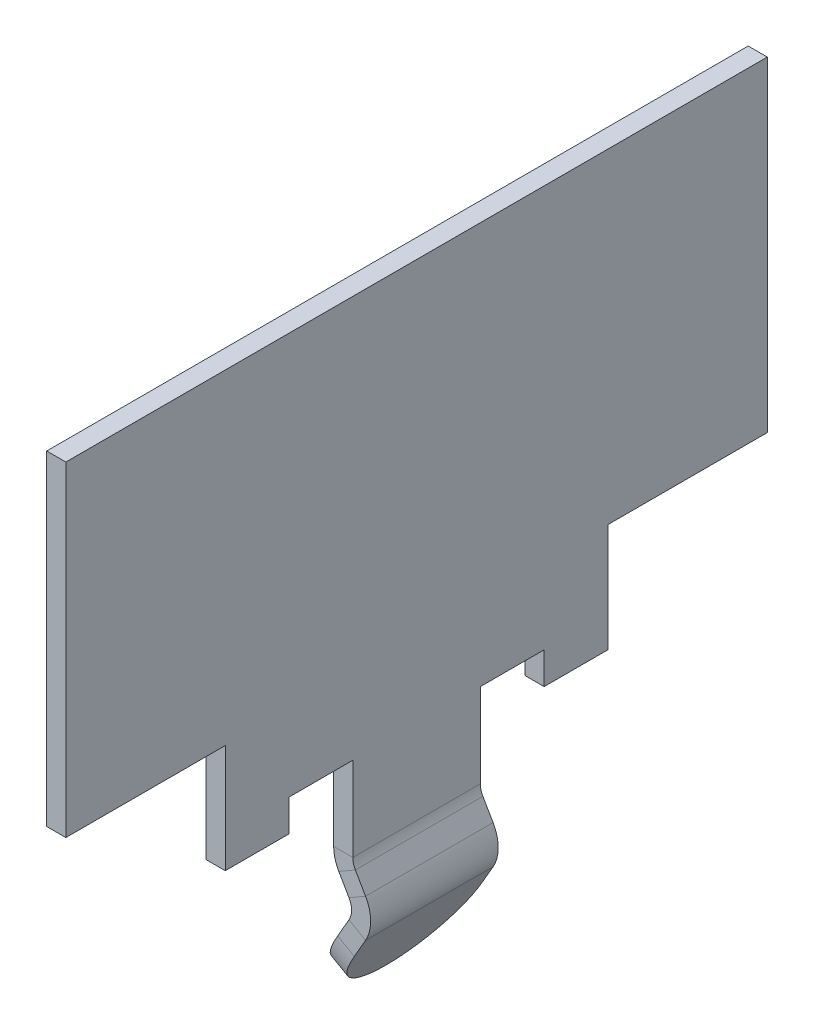
ISO-10303-21;
HEADER;
FILE_DESCRIPTION(('STEP AP214'),'2;1');
FILE_NAME('part.step','',(''),(''),'','','');
FILE_SCHEMA(('AUTOMOTIVE_DESIGN { 1 0 10303 214 1 1 1 1 }'));
ENDSEC;
DATA;
#1=APPLICATION_CONTEXT('core data for automotive mechanical design processes');
#2=APPLICATION_PROTOCOL_DEFINITION('international standard','automotive_design',2000,#1);
#3=PRODUCT_CONTEXT('',#1,'mechanical');
#4=PRODUCT('Part','Part','',(#3));
#5=PRODUCT_RELATED_PRODUCT_CATEGORY('part','',(#4));
#6=PRODUCT_DEFINITION_FORMATION('','',#4);
#7=PRODUCT_DEFINITION_CONTEXT('part definition',#1,'design');
#8=PRODUCT_DEFINITION('design','',#6,#7);
#9=PRODUCT_DEFINITION_SHAPE('','',#8);
#10=(LENGTH_UNIT() NAMED_UNIT(*) SI_UNIT(.MILLI.,.METRE.));
#11=(NAMED_UNIT(*) PLANE_ANGLE_UNIT() SI_UNIT($,.RADIAN.));
#12=(NAMED_UNIT(*) SI_UNIT($,.STERADIAN.) SOLID_ANGLE_UNIT());
#13=UNCERTAINTY_MEASURE_WITH_UNIT(LENGTH_MEASURE(1.E-05),#10,'distance_accuracy_value','');
#14=(GEOMETRIC_REPRESENTATION_CONTEXT(3) GLOBAL_UNCERTAINTY_ASSIGNED_CONTEXT((#13)) GLOBAL_UNIT_ASSIGNED_CONTEXT((#10,
#11,#12)) REPRESENTATION_CONTEXT('',''));
#15=CARTESIAN_POINT('',(0.,0.,0.));
#16=DIRECTION('',(0.,0.,1.));
#17=DIRECTION('',(1.,0.,0.));
#18=AXIS2_PLACEMENT_3D('',#15,#16,#17);
#19=CARTESIAN_POINT('',(-4.876794919243,-3.852627944163,0.));
#20=DIRECTION('',(-0.866025403784329,0.50000000000019,0.));
#21=DIRECTION('',(-0.50000000000019,-0.866025403784329,0.));
#22=AXIS2_PLACEMENT_3D('',#19,#20,#21);
#23=CYLINDRICAL_SURFACE('',#22,1.);
#24=CARTESIAN_POINT('',(-4.876794919243,-3.852627944163,0.));
#25=DIRECTION('',(0.866025403784329,-0.50000000000019,0.));
#26=DIRECTION('',(-0.50000000000019,-0.866025403784329,0.));
#27=AXIS2_PLACEMENT_3D('',#24,#25,#26);
#28=CIRCLE('',#27,1.);
#29=CARTESIAN_POINT('',(-5.376794919243,-4.718653347947,0.));
#30=VERTEX_POINT('',#29);
#31=CARTESIAN_POINT('',(-4.876794919243,-3.852627944163,-1.));
#32=VERTEX_POINT('',#31);
#33=EDGE_CURVE('E235',#30,#32,#28,.T.);
#34=ORIENTED_EDGE('',*,*,#33,.F.);
#35=DIRECTION('',(-0.866025403784329,0.50000000000019,0.));
#36=VECTOR('',#35,1.);
#37=CARTESIAN_POINT('',(-5.376794919243,-4.718653347947,0.));
#38=LINE('',#37,#36);
#39=CARTESIAN_POINT('',(-5.636602540378,-4.568653347947,0.));
#40=VERTEX_POINT('',#39);
#41=EDGE_CURVE('E11',#30,#40,#38,.T.);
#42=ORIENTED_EDGE('',*,*,#41,.T.);
#43=CARTESIAN_POINT('',(-5.136602540378,-3.702627944163,0.));
#44=DIRECTION('',(-0.866025403784329,0.50000000000019,0.));
#45=DIRECTION('',(-0.50000000000019,-0.866025403784329,0.));
#46=AXIS2_PLACEMENT_3D('',#43,#44,#45);
#47=CIRCLE('',#46,1.);
#48=CARTESIAN_POINT('',(-5.136602540378,-3.702627944163,-1.));
#49=VERTEX_POINT('',#48);
#50=EDGE_CURVE('E245',#49,#40,#47,.T.);
#51=ORIENTED_EDGE('',*,*,#50,.F.);
#52=DIRECTION('',(-0.866025403784329,0.50000000000019,0.));
#53=VECTOR('',#52,1.);
#54=CARTESIAN_POINT('',(-4.876794919243,-3.852627944163,-1.));
#55=LINE('',#54,#53);
#56=EDGE_CURVE('E248',#32,#49,#55,.T.);
#57=ORIENTED_EDGE('',*,*,#56,.F.);
#58=EDGE_LOOP('',(#34,#42,#51,#57));
#59=FACE_BOUND('',#58,.T.);
#60=ADVANCED_FACE('F17',(#59),#23,.T.);
#61=CARTESIAN_POINT('',(-4.876794919243,-3.852627944163,0.));
#62=DIRECTION('',(-0.866025403784329,0.50000000000019,0.));
#63=DIRECTION('',(-0.50000000000019,-0.866025403784329,0.));
#64=AXIS2_PLACEMENT_3D('',#61,#62,#63);
#65=CYLINDRICAL_SURFACE('',#64,1.);
#66=ORIENTED_EDGE('',*,*,#41,.F.);
#67=CARTESIAN_POINT('',(-4.876794919243,-3.852627944163,0.));
#68=DIRECTION('',(0.866025403784329,-0.50000000000019,0.));
#69=DIRECTION('',(-0.50000000000019,-0.866025403784329,0.));
#70=AXIS2_PLACEMENT_3D('',#67,#68,#69);
#71=CIRCLE('',#70,1.);
#72=CARTESIAN_POINT('',(-4.876794919243,-3.852627944163,1.));
#73=VERTEX_POINT('',#72);
#74=EDGE_CURVE('E243',#73,#30,#71,.T.);
#75=ORIENTED_EDGE('',*,*,#74,.F.);
#76=DIRECTION('',(0.866025403784329,-0.50000000000019,0.));
#77=VECTOR('',#76,1.);
#78=CARTESIAN_POINT('',(-4.876794919243,-3.852627944163,1.));
#79=LINE('',#78,#77);
#80=CARTESIAN_POINT('',(-5.136602540378,-3.702627944163,1.));
#81=VERTEX_POINT('',#80);
#82=EDGE_CURVE('E266',#81,#73,#79,.T.);
#83=ORIENTED_EDGE('',*,*,#82,.F.);
#84=CARTESIAN_POINT('',(-5.136602540378,-3.702627944163,0.));
#85=DIRECTION('',(-0.866025403784329,0.50000000000019,0.));
#86=DIRECTION('',(-0.50000000000019,-0.866025403784329,0.));
#87=AXIS2_PLACEMENT_3D('',#84,#85,#86);
#88=CIRCLE('',#87,1.);
#89=EDGE_CURVE('E26',#40,#81,#88,.T.);
#90=ORIENTED_EDGE('',*,*,#89,.F.);
#91=EDGE_LOOP('',(#66,#75,#83,#90));
#92=FACE_BOUND('',#91,.T.);
#93=ADVANCED_FACE('F19',(#92),#65,.T.);
#94=CARTESIAN_POINT('',(-2.162564434702,1.448557158515,0.));
#95=DIRECTION('',(-0.866025403784329,0.50000000000019,0.));
#96=DIRECTION('',(0.,0.,1.));
#97=AXIS2_PLACEMENT_3D('',#94,#95,#96);
#98=PLANE('',#97);
#99=DIRECTION('',(0.50000000000019,0.866025403784329,0.));
#100=VECTOR('',#99,1.);
#101=CARTESIAN_POINT('',(-4.873205080757,-3.246410161514,-1.));
#102=LINE('',#101,#100);
#103=CARTESIAN_POINT('',(-4.959807621135,-3.396410161514,-1.));
#104=VERTEX_POINT('',#103);
#105=EDGE_CURVE('E253',#49,#104,#102,.T.);
#106=ORIENTED_EDGE('',*,*,#105,.F.);
#107=ORIENTED_EDGE('',*,*,#50,.T.);
#108=ORIENTED_EDGE('',*,*,#89,.T.);
#109=DIRECTION('',(-0.50000000000019,-0.866025403784329,0.));
#110=VECTOR('',#109,1.);
#111=CARTESIAN_POINT('',(-5.636602540378,-4.568653347947,1.));
#112=LINE('',#111,#110);
#113=CARTESIAN_POINT('',(-4.959807621135,-3.396410161514,1.));
#114=VERTEX_POINT('',#113);
#115=EDGE_CURVE('E301',#114,#81,#112,.T.);
#116=ORIENTED_EDGE('',*,*,#115,.F.);
#117=DIRECTION('',(0.,0.,1.));
#118=VECTOR('',#117,1.);
#119=CARTESIAN_POINT('',(-4.959807621135,-3.396410161514,-1.));
#120=LINE('',#119,#118);
#121=EDGE_CURVE('E298',#104,#114,#120,.T.);
#122=ORIENTED_EDGE('',*,*,#121,.F.);
#123=EDGE_LOOP('',(#106,#107,#108,#116,#122));
#124=FACE_BOUND('',#123,.T.);
#125=ADVANCED_FACE('F646',(#124),#98,.T.);
#126=CARTESIAN_POINT('',(-1.902756813566,1.298557158515,0.));
#127=DIRECTION('',(-0.866025403784329,0.50000000000019,0.));
#128=DIRECTION('',(0.,0.,1.));
#129=AXIS2_PLACEMENT_3D('',#126,#127,#128);
#130=PLANE('',#129);
#131=ORIENTED_EDGE('',*,*,#74,.T.);
#132=ORIENTED_EDGE('',*,*,#33,.T.);
#133=DIRECTION('',(0.50000000000019,0.866025403784329,0.));
#134=VECTOR('',#133,1.);
#135=CARTESIAN_POINT('',(-1.902756813566,1.298557158515,-1.));
#136=LINE('',#135,#134);
#137=CARTESIAN_POINT('',(-4.7,-3.546410161514,-1.));
#138=VERTEX_POINT('',#137);
#139=EDGE_CURVE('E240',#32,#138,#136,.T.);
#140=ORIENTED_EDGE('',*,*,#139,.T.);
#141=DIRECTION('',(0.,0.,-1.));
#142=VECTOR('',#141,1.);
#143=CARTESIAN_POINT('',(-4.7,-3.546410161514,-1.));
#144=LINE('',#143,#142);
#145=CARTESIAN_POINT('',(-4.7,-3.546410161514,1.));
#146=VERTEX_POINT('',#145);
#147=EDGE_CURVE('E302',#146,#138,#144,.T.);
#148=ORIENTED_EDGE('',*,*,#147,.F.);
#149=DIRECTION('',(-0.50000000000019,-0.866025403784329,0.));
#150=VECTOR('',#149,1.);
#151=CARTESIAN_POINT('',(-1.902756813566,1.298557158515,1.));
#152=LINE('',#151,#150);
#153=EDGE_CURVE('E260',#146,#73,#152,.T.);
#154=ORIENTED_EDGE('',*,*,#153,.T.);
#155=EDGE_LOOP('',(#131,#132,#140,#148,#154));
#156=FACE_BOUND('',#155,.T.);
#157=ADVANCED_FACE('F237',(#156),#130,.F.);
#158=CARTESIAN_POINT('',(-4.613397459622,-3.396410161514,-1.));
#159=DIRECTION('',(0.,0.,1.));
#160=DIRECTION('',(1.,0.,0.));
#161=AXIS2_PLACEMENT_3D('',#158,#159,#160);
#162=PLANE('',#161);
#163=ORIENTED_EDGE('',*,*,#139,.F.);
#164=ORIENTED_EDGE('',*,*,#56,.T.);
#165=ORIENTED_EDGE('',*,*,#105,.T.);
#166=DIRECTION('',(0.866025403784329,-0.50000000000019,0.));
#167=VECTOR('',#166,1.);
#168=CARTESIAN_POINT('',(-4.7,-3.546410161514,-1.));
#169=LINE('',#168,#167);
#170=EDGE_CURVE('E258',#104,#138,#169,.T.);
#171=ORIENTED_EDGE('',*,*,#170,.T.);
#172=EDGE_LOOP('',(#163,#164,#165,#171));
#173=FACE_BOUND('',#172,.T.);
#174=ADVANCED_FACE('F256',(#173),#162,.F.);
#175=CARTESIAN_POINT('',(-5.376794919243,-4.718653347947,1.));
#176=DIRECTION('',(0.,0.,-1.));
#177=DIRECTION('',(0.,-1.,0.));
#178=AXIS2_PLACEMENT_3D('',#175,#176,#177);
#179=PLANE('',#178);
#180=ORIENTED_EDGE('',*,*,#115,.T.);
#181=ORIENTED_EDGE('',*,*,#82,.T.);
#182=ORIENTED_EDGE('',*,*,#153,.F.);
#183=DIRECTION('',(0.866025403784329,-0.50000000000019,0.));
#184=VECTOR('',#183,1.);
#185=CARTESIAN_POINT('',(-4.959807621135,-3.396410161514,1.));
#186=LINE('',#185,#184);
#187=EDGE_CURVE('E293',#114,#146,#186,.T.);
#188=ORIENTED_EDGE('',*,*,#187,.F.);
#189=EDGE_LOOP('',(#180,#181,#182,#188));
#190=FACE_BOUND('',#189,.T.);
#191=ADVANCED_FACE('F655',(#190),#179,.F.);
#192=CARTESIAN_POINT('',(-5.219615242271,-3.246410161514,1.));
#193=DIRECTION('',(0.,0.,1.));
#194=DIRECTION('',(0.866025403784329,-0.50000000000019,0.));
#195=AXIS2_PLACEMENT_3D('',#192,#193,#194);
#196=CYLINDRICAL_SURFACE('',#195,0.3);
#197=DIRECTION('',(0.,0.,-1.));
#198=VECTOR('',#197,1.);
#199=CARTESIAN_POINT('',(-4.959807621135,-3.096410161514,1.));
#200=LINE('',#199,#198);
#201=CARTESIAN_POINT('',(-4.959807621135,-3.096410161514,1.));
#202=VERTEX_POINT('',#201);
#203=CARTESIAN_POINT('',(-4.959807621135,-3.096410161514,-1.));
#204=VERTEX_POINT('',#203);
#205=EDGE_CURVE('E480',#202,#204,#200,.T.);
#206=ORIENTED_EDGE('',*,*,#205,.T.);
#207=CARTESIAN_POINT('',(-5.219615242271,-3.246410161514,-1.));
#208=DIRECTION('',(0.,0.,-1.));
#209=DIRECTION('',(1.,0.,0.));
#210=AXIS2_PLACEMENT_3D('',#207,#208,#209);
#211=CIRCLE('',#210,0.3);
#212=EDGE_CURVE('E279',#204,#104,#211,.T.);
#213=ORIENTED_EDGE('',*,*,#212,.T.);
#214=ORIENTED_EDGE('',*,*,#121,.T.);
#215=CARTESIAN_POINT('',(-5.219615242271,-3.246410161514,1.));
#216=DIRECTION('',(0.,0.,1.));
#217=DIRECTION('',(1.,0.,0.));
#218=AXIS2_PLACEMENT_3D('',#215,#216,#217);
#219=CIRCLE('',#218,0.3);
#220=EDGE_CURVE('E290',#114,#202,#219,.T.);
#221=ORIENTED_EDGE('',*,*,#220,.T.);
#222=EDGE_LOOP('',(#206,#213,#214,#221));
#223=FACE_BOUND('',#222,.T.);
#224=ADVANCED_FACE('F662',(#223),#196,.F.);
#225=CARTESIAN_POINT('',(-5.219615242271,-3.246410161514,1.));
#226=DIRECTION('',(0.,0.,1.));
#227=DIRECTION('',(0.866025403784329,-0.50000000000019,0.));
#228=AXIS2_PLACEMENT_3D('',#225,#226,#227);
#229=CYLINDRICAL_SURFACE('',#228,0.6);
#230=DIRECTION('',(0.,0.,-1.));
#231=VECTOR('',#230,1.);
#232=CARTESIAN_POINT('',(-4.7,-2.946410161514,1.));
#233=LINE('',#232,#231);
#234=CARTESIAN_POINT('',(-4.7,-2.946410161514,1.));
#235=VERTEX_POINT('',#234);
#236=CARTESIAN_POINT('',(-4.7,-2.946410161514,-1.));
#237=VERTEX_POINT('',#236);
#238=EDGE_CURVE('E506',#235,#237,#233,.T.);
#239=ORIENTED_EDGE('',*,*,#238,.F.);
#240=CARTESIAN_POINT('',(-5.219615242271,-3.246410161514,1.));
#241=DIRECTION('',(0.,0.,1.));
#242=DIRECTION('',(1.,0.,0.));
#243=AXIS2_PLACEMENT_3D('',#240,#241,#242);
#244=CIRCLE('',#243,0.6);
#245=EDGE_CURVE('E297',#146,#235,#244,.T.);
#246=ORIENTED_EDGE('',*,*,#245,.F.);
#247=ORIENTED_EDGE('',*,*,#147,.T.);
#248=CARTESIAN_POINT('',(-5.219615242271,-3.246410161514,-1.));
#249=DIRECTION('',(0.,0.,-1.));
#250=DIRECTION('',(1.,0.,0.));
#251=AXIS2_PLACEMENT_3D('',#248,#249,#250);
#252=CIRCLE('',#251,0.6);
#253=EDGE_CURVE('E283',#237,#138,#252,.T.);
#254=ORIENTED_EDGE('',*,*,#253,.F.);
#255=EDGE_LOOP('',(#239,#246,#247,#254));
#256=FACE_BOUND('',#255,.T.);
#257=ADVANCED_FACE('F666',(#256),#229,.T.);
#258=CARTESIAN_POINT('',(-5.219615242271,-3.246410161514,1.));
#259=DIRECTION('',(0.,0.,-1.));
#260=DIRECTION('',(0.,-1.,0.));
#261=AXIS2_PLACEMENT_3D('',#258,#259,#260);
#262=PLANE('',#261);
#263=ORIENTED_EDGE('',*,*,#220,.F.);
#264=ORIENTED_EDGE('',*,*,#187,.T.);
#265=ORIENTED_EDGE('',*,*,#245,.T.);
#266=DIRECTION('',(0.866025403784329,0.50000000000019,0.));
#267=VECTOR('',#266,1.);
#268=CARTESIAN_POINT('',(-4.959807621135,-3.096410161514,1.));
#269=LINE('',#268,#267);
#270=EDGE_CURVE('E462',#202,#235,#269,.T.);
#271=ORIENTED_EDGE('',*,*,#270,.F.);
#272=EDGE_LOOP('',(#263,#264,#265,#271));
#273=FACE_BOUND('',#272,.T.);
#274=ADVANCED_FACE('F670',(#273),#262,.F.);
#275=CARTESIAN_POINT('',(-5.219615242271,-3.246410161514,-1.));
#276=DIRECTION('',(0.,0.,-1.));
#277=DIRECTION('',(0.,-1.,0.));
#278=AXIS2_PLACEMENT_3D('',#275,#276,#277);
#279=PLANE('',#278);
#280=ORIENTED_EDGE('',*,*,#170,.F.);
#281=ORIENTED_EDGE('',*,*,#212,.F.);
#282=DIRECTION('',(0.866025403784329,0.50000000000019,0.));
#283=VECTOR('',#282,1.);
#284=CARTESIAN_POINT('',(-4.959807621135,-3.096410161514,-1.));
#285=LINE('',#284,#283);
#286=EDGE_CURVE('E287',#204,#237,#285,.T.);
#287=ORIENTED_EDGE('',*,*,#286,.T.);
#288=ORIENTED_EDGE('',*,*,#253,.T.);
#289=EDGE_LOOP('',(#280,#281,#287,#288));
#290=FACE_BOUND('',#289,.T.);
#291=ADVANCED_FACE('F674',(#290),#279,.T.);
#292=CARTESIAN_POINT('',(-5.159807621135,-2.75,-1.));
#293=DIRECTION('',(0.,0.,-1.));
#294=DIRECTION('',(-1.,0.,0.));
#295=AXIS2_PLACEMENT_3D('',#292,#293,#294);
#296=PLANE('',#295);
#297=ORIENTED_EDGE('',*,*,#286,.F.);
#298=DIRECTION('',(-0.50000000000019,0.866025403784329,0.));
#299=VECTOR('',#298,1.);
#300=CARTESIAN_POINT('',(-5.159807621135,-2.75,-1.));
#301=LINE('',#300,#299);
#302=CARTESIAN_POINT('',(-5.119615242271,-2.819615242271,-1.));
#303=VERTEX_POINT('',#302);
#304=EDGE_CURVE('E476',#204,#303,#301,.T.);
#305=ORIENTED_EDGE('',*,*,#304,.T.);
#306=DIRECTION('',(-0.866025403784329,-0.50000000000019,0.));
#307=VECTOR('',#306,1.);
#308=CARTESIAN_POINT('',(-4.859807621135,-2.669615242271,-1.));
#309=LINE('',#308,#307);
#310=CARTESIAN_POINT('',(-4.859807621135,-2.669615242271,-1.));
#311=VERTEX_POINT('',#310);
#312=EDGE_CURVE('E278',#311,#303,#309,.T.);
#313=ORIENTED_EDGE('',*,*,#312,.F.);
#314=DIRECTION('',(-0.50000000000019,0.866025403784329,0.));
#315=VECTOR('',#314,1.);
#316=CARTESIAN_POINT('',(-4.411121593217,-3.446762239272,-1.));
#317=LINE('',#316,#315);
#318=EDGE_CURVE('E510',#237,#311,#317,.T.);
#319=ORIENTED_EDGE('',*,*,#318,.F.);
#320=EDGE_LOOP('',(#297,#305,#313,#319));
#321=FACE_BOUND('',#320,.T.);
#322=ADVANCED_FACE('F676',(#321),#296,.T.);
#323=CARTESIAN_POINT('',(-4.6,-2.519615242271,-1.));
#324=DIRECTION('',(0.,0.,-1.));
#325=DIRECTION('',(-0.866025403784329,-0.50000000000019,0.));
#326=AXIS2_PLACEMENT_3D('',#323,#324,#325);
#327=CYLINDRICAL_SURFACE('',#326,0.3);
#328=DIRECTION('',(0.,0.,1.));
#329=VECTOR('',#328,1.);
#330=CARTESIAN_POINT('',(-4.9,-2.519615242271,-1.));
#331=LINE('',#330,#329);
#332=CARTESIAN_POINT('',(-4.9,-2.519615242271,-1.));
#333=VERTEX_POINT('',#332);
#334=CARTESIAN_POINT('',(-4.9,-2.519615242271,1.));
#335=VERTEX_POINT('',#334);
#336=EDGE_CURVE('E270',#333,#335,#331,.T.);
#337=ORIENTED_EDGE('',*,*,#336,.T.);
#338=CARTESIAN_POINT('',(-4.6,-2.519615242271,1.));
#339=DIRECTION('',(0.,0.,1.));
#340=DIRECTION('',(-1.,0.,0.));
#341=AXIS2_PLACEMENT_3D('',#338,#339,#340);
#342=CIRCLE('',#341,0.3);
#343=CARTESIAN_POINT('',(-4.859807621135,-2.669615242271,1.));
#344=VERTEX_POINT('',#343);
#345=EDGE_CURVE('E272',#335,#344,#342,.T.);
#346=ORIENTED_EDGE('',*,*,#345,.T.);
#347=DIRECTION('',(0.,0.,-1.));
#348=VECTOR('',#347,1.);
#349=CARTESIAN_POINT('',(-4.859807621135,-2.669615242271,1.));
#350=LINE('',#349,#348);
#351=EDGE_CURVE('E502',#344,#311,#350,.T.);
#352=ORIENTED_EDGE('',*,*,#351,.T.);
#353=CARTESIAN_POINT('',(-4.6,-2.519615242271,-1.));
#354=DIRECTION('',(0.,0.,-1.));
#355=DIRECTION('',(-1.,0.,0.));
#356=AXIS2_PLACEMENT_3D('',#353,#354,#355);
#357=CIRCLE('',#356,0.3);
#358=EDGE_CURVE('E275',#311,#333,#357,.T.);
#359=ORIENTED_EDGE('',*,*,#358,.T.);
#360=EDGE_LOOP('',(#337,#346,#352,#359));
#361=FACE_BOUND('',#360,.T.);
#362=ADVANCED_FACE('F679',(#361),#327,.F.);
#363=CARTESIAN_POINT('',(-4.6,-2.519615242271,-1.));
#364=DIRECTION('',(0.,0.,-1.));
#365=DIRECTION('',(-0.866025403784329,-0.50000000000019,0.));
#366=AXIS2_PLACEMENT_3D('',#363,#364,#365);
#367=CYLINDRICAL_SURFACE('',#366,0.6);
#368=DIRECTION('',(0.,0.,1.));
#369=VECTOR('',#368,1.);
#370=CARTESIAN_POINT('',(-5.2,-2.519615242271,-1.));
#371=LINE('',#370,#369);
#372=CARTESIAN_POINT('',(-5.2,-2.519615242271,-1.));
#373=VERTEX_POINT('',#372);
#374=CARTESIAN_POINT('',(-5.2,-2.519615242271,1.));
#375=VERTEX_POINT('',#374);
#376=EDGE_CURVE('E420',#373,#375,#371,.T.);
#377=ORIENTED_EDGE('',*,*,#376,.F.);
#378=CARTESIAN_POINT('',(-4.6,-2.519615242271,-1.));
#379=DIRECTION('',(0.,0.,-1.));
#380=DIRECTION('',(-1.,0.,0.));
#381=AXIS2_PLACEMENT_3D('',#378,#379,#380);
#382=CIRCLE('',#381,0.6);
#383=EDGE_CURVE('E284',#303,#373,#382,.T.);
#384=ORIENTED_EDGE('',*,*,#383,.F.);
#385=DIRECTION('',(0.,0.,-1.));
#386=VECTOR('',#385,1.);
#387=CARTESIAN_POINT('',(-5.119615242271,-2.819615242271,0.));
#388=LINE('',#387,#386);
#389=CARTESIAN_POINT('',(-5.119615242271,-2.819615242271,1.));
#390=VERTEX_POINT('',#389);
#391=EDGE_CURVE('E496',#390,#303,#388,.T.);
#392=ORIENTED_EDGE('',*,*,#391,.F.);
#393=CARTESIAN_POINT('',(-4.6,-2.519615242271,1.));
#394=DIRECTION('',(0.,0.,1.));
#395=DIRECTION('',(-1.,0.,0.));
#396=AXIS2_PLACEMENT_3D('',#393,#394,#395);
#397=CIRCLE('',#396,0.6);
#398=EDGE_CURVE('E274',#375,#390,#397,.T.);
#399=ORIENTED_EDGE('',*,*,#398,.F.);
#400=EDGE_LOOP('',(#377,#384,#392,#399));
#401=FACE_BOUND('',#400,.T.);
#402=ADVANCED_FACE('F600',(#401),#367,.T.);
#403=CARTESIAN_POINT('',(-4.6,-2.519615242271,-1.));
#404=DIRECTION('',(0.,0.,1.));
#405=DIRECTION('',(1.,0.,0.));
#406=AXIS2_PLACEMENT_3D('',#403,#404,#405);
#407=PLANE('',#406);
#408=ORIENTED_EDGE('',*,*,#358,.F.);
#409=ORIENTED_EDGE('',*,*,#312,.T.);
#410=ORIENTED_EDGE('',*,*,#383,.T.);
#411=DIRECTION('',(-1.,0.,0.));
#412=VECTOR('',#411,1.);
#413=CARTESIAN_POINT('',(-4.9,-2.519615242271,-1.));
#414=LINE('',#413,#412);
#415=EDGE_CURVE('E354',#333,#373,#414,.T.);
#416=ORIENTED_EDGE('',*,*,#415,.F.);
#417=EDGE_LOOP('',(#408,#409,#410,#416));
#418=FACE_BOUND('',#417,.T.);
#419=ADVANCED_FACE('F597',(#418),#407,.F.);
#420=CARTESIAN_POINT('',(-4.6,-2.519615242271,1.));
#421=DIRECTION('',(0.,0.,1.));
#422=DIRECTION('',(1.,0.,0.));
#423=AXIS2_PLACEMENT_3D('',#420,#421,#422);
#424=PLANE('',#423);
#425=DIRECTION('',(-0.866025403784329,-0.50000000000019,0.));
#426=VECTOR('',#425,1.);
#427=CARTESIAN_POINT('',(-5.119615242271,-2.819615242271,1.));
#428=LINE('',#427,#426);
#429=EDGE_CURVE('E473',#344,#390,#428,.T.);
#430=ORIENTED_EDGE('',*,*,#429,.F.);
#431=ORIENTED_EDGE('',*,*,#345,.F.);
#432=DIRECTION('',(-1.,0.,0.));
#433=VECTOR('',#432,1.);
#434=CARTESIAN_POINT('',(-4.9,-2.519615242271,1.));
#435=LINE('',#434,#433);
#436=EDGE_CURVE('E368',#335,#375,#435,.T.);
#437=ORIENTED_EDGE('',*,*,#436,.T.);
#438=ORIENTED_EDGE('',*,*,#398,.T.);
#439=EDGE_LOOP('',(#430,#431,#437,#438));
#440=FACE_BOUND('',#439,.T.);
#441=ADVANCED_FACE('F603',(#440),#424,.T.);
#442=CARTESIAN_POINT('',(-4.9,0.,0.));
#443=DIRECTION('',(1.,0.,0.));
#444=DIRECTION('',(0.,0.,-1.));
#445=AXIS2_PLACEMENT_3D('',#442,#443,#444);
#446=PLANE('',#445);
#447=DIRECTION('',(0.,1.,0.));
#448=VECTOR('',#447,1.);
#449=CARTESIAN_POINT('',(-4.9,0.,5.5));
#450=LINE('',#449,#448);
#451=CARTESIAN_POINT('',(-4.9,0.,5.5));
#452=VERTEX_POINT('',#451);
#453=CARTESIAN_POINT('',(-4.9,5.1,5.5));
#454=VERTEX_POINT('',#453);
#455=EDGE_CURVE('E455',#452,#454,#450,.T.);
#456=ORIENTED_EDGE('',*,*,#455,.F.);
#457=DIRECTION('',(0.,0.,1.));
#458=VECTOR('',#457,1.);
#459=CARTESIAN_POINT('',(-4.9,0.,5.5));
#460=LINE('',#459,#458);
#461=CARTESIAN_POINT('',(-4.9,0.,3.));
#462=VERTEX_POINT('',#461);
#463=EDGE_CURVE('E419',#462,#452,#460,.T.);
#464=ORIENTED_EDGE('',*,*,#463,.F.);
#465=DIRECTION('',(0.,1.,0.));
#466=VECTOR('',#465,1.);
#467=CARTESIAN_POINT('',(-4.9,-1.7,3.));
#468=LINE('',#467,#466);
#469=CARTESIAN_POINT('',(-4.9,-1.7,3.));
#470=VERTEX_POINT('',#469);
#471=EDGE_CURVE('E409',#470,#462,#468,.T.);
#472=ORIENTED_EDGE('',*,*,#471,.F.);
#473=DIRECTION('',(0.,0.,1.));
#474=VECTOR('',#473,1.);
#475=CARTESIAN_POINT('',(-4.9,-1.7,2.));
#476=LINE('',#475,#474);
#477=CARTESIAN_POINT('',(-4.9,-1.7,2.));
#478=VERTEX_POINT('',#477);
#479=EDGE_CURVE('E401',#478,#470,#476,.T.);
#480=ORIENTED_EDGE('',*,*,#479,.F.);
#481=DIRECTION('',(0.,-1.,0.));
#482=VECTOR('',#481,1.);
#483=CARTESIAN_POINT('',(-4.9,-1.7,2.));
#484=LINE('',#483,#482);
#485=CARTESIAN_POINT('',(-4.9,-1.2,2.));
#486=VERTEX_POINT('',#485);
#487=EDGE_CURVE('E389',#486,#478,#484,.T.);
#488=ORIENTED_EDGE('',*,*,#487,.F.);
#489=DIRECTION('',(0.,0.,1.));
#490=VECTOR('',#489,1.);
#491=CARTESIAN_POINT('',(-4.9,-1.2,1.));
#492=LINE('',#491,#490);
#493=CARTESIAN_POINT('',(-4.9,-1.2,1.));
#494=VERTEX_POINT('',#493);
#495=EDGE_CURVE('E372',#494,#486,#492,.T.);
#496=ORIENTED_EDGE('',*,*,#495,.F.);
#497=DIRECTION('',(0.,1.,0.));
#498=VECTOR('',#497,1.);
#499=CARTESIAN_POINT('',(-4.9,-1.7,1.));
#500=LINE('',#499,#498);
#501=EDGE_CURVE('E345',#335,#494,#500,.T.);
#502=ORIENTED_EDGE('',*,*,#501,.F.);
#503=ORIENTED_EDGE('',*,*,#336,.F.);
#504=DIRECTION('',(0.,-1.,0.));
#505=VECTOR('',#504,1.);
#506=CARTESIAN_POINT('',(-4.9,-1.7,-1.));
#507=LINE('',#506,#505);
#508=CARTESIAN_POINT('',(-4.9,-1.2,-1.));
#509=VERTEX_POINT('',#508);
#510=EDGE_CURVE('E344',#509,#333,#507,.T.);
#511=ORIENTED_EDGE('',*,*,#510,.F.);
#512=DIRECTION('',(0.,0.,1.));
#513=VECTOR('',#512,1.);
#514=CARTESIAN_POINT('',(-4.9,-1.2,-1.));
#515=LINE('',#514,#513);
#516=CARTESIAN_POINT('',(-4.9,-1.2,-2.));
#517=VERTEX_POINT('',#516);
#518=EDGE_CURVE('E335',#517,#509,#515,.T.);
#519=ORIENTED_EDGE('',*,*,#518,.F.);
#520=DIRECTION('',(0.,1.,0.));
#521=VECTOR('',#520,1.);
#522=CARTESIAN_POINT('',(-4.9,-1.7,-2.));
#523=LINE('',#522,#521);
#524=CARTESIAN_POINT('',(-4.9,-1.7,-2.));
#525=VERTEX_POINT('',#524);
#526=EDGE_CURVE('E323',#525,#517,#523,.T.);
#527=ORIENTED_EDGE('',*,*,#526,.F.);
#528=DIRECTION('',(0.,0.,1.));
#529=VECTOR('',#528,1.);
#530=CARTESIAN_POINT('',(-4.9,-1.7,-3.));
#531=LINE('',#530,#529);
#532=CARTESIAN_POINT('',(-4.9,-1.7,-3.));
#533=VERTEX_POINT('',#532);
#534=EDGE_CURVE('E569',#533,#525,#531,.T.);
#535=ORIENTED_EDGE('',*,*,#534,.F.);
#536=DIRECTION('',(0.,-1.,0.));
#537=VECTOR('',#536,1.);
#538=CARTESIAN_POINT('',(-4.9,-1.7,-3.));
#539=LINE('',#538,#537);
#540=CARTESIAN_POINT('',(-4.9,0.,-3.));
#541=VERTEX_POINT('',#540);
#542=EDGE_CURVE('E488',#541,#533,#539,.T.);
#543=ORIENTED_EDGE('',*,*,#542,.F.);
#544=DIRECTION('',(0.,0.,1.));
#545=VECTOR('',#544,1.);
#546=CARTESIAN_POINT('',(-4.9,0.,-5.5));
#547=LINE('',#546,#545);
#548=CARTESIAN_POINT('',(-4.9,0.,-5.5));
#549=VERTEX_POINT('',#548);
#550=EDGE_CURVE('E541',#549,#541,#547,.T.);
#551=ORIENTED_EDGE('',*,*,#550,.F.);
#552=DIRECTION('',(0.,-1.,0.));
#553=VECTOR('',#552,1.);
#554=CARTESIAN_POINT('',(-4.9,0.,-5.5));
#555=LINE('',#554,#553);
#556=CARTESIAN_POINT('',(-4.9,5.1,-5.5));
#557=VERTEX_POINT('',#556);
#558=EDGE_CURVE('E527',#557,#549,#555,.T.);
#559=ORIENTED_EDGE('',*,*,#558,.F.);
#560=DIRECTION('',(0.,0.,-1.));
#561=VECTOR('',#560,1.);
#562=CARTESIAN_POINT('',(-4.9,5.1,-5.5));
#563=LINE('',#562,#561);
#564=EDGE_CURVE('E446',#454,#557,#563,.T.);
#565=ORIENTED_EDGE('',*,*,#564,.F.);
#566=EDGE_LOOP('',(#456,#464,#472,#480,#488,#496,#502,#503,#511,#519,#527,#535,#543,#551,#559,#565));
#567=FACE_BOUND('',#566,.T.);
#568=ADVANCED_FACE('F586',(#567),#446,.T.);
#569=CARTESIAN_POINT('',(-5.2,0.,0.));
#570=DIRECTION('',(1.,0.,0.));
#571=DIRECTION('',(0.,0.,-1.));
#572=AXIS2_PLACEMENT_3D('',#569,#570,#571);
#573=PLANE('',#572);
#574=DIRECTION('',(0.,1.,0.));
#575=VECTOR('',#574,1.);
#576=CARTESIAN_POINT('',(-5.2,0.,5.5));
#577=LINE('',#576,#575);
#578=CARTESIAN_POINT('',(-5.2,0.,5.5));
#579=VERTEX_POINT('',#578);
#580=CARTESIAN_POINT('',(-5.2,5.1,5.5));
#581=VERTEX_POINT('',#580);
#582=EDGE_CURVE('E434',#579,#581,#577,.T.);
#583=ORIENTED_EDGE('',*,*,#582,.T.);
#584=DIRECTION('',(0.,0.,-1.));
#585=VECTOR('',#584,1.);
#586=CARTESIAN_POINT('',(-5.2,5.1,-5.5));
#587=LINE('',#586,#585);
#588=CARTESIAN_POINT('',(-5.2,5.1,-5.5));
#589=VERTEX_POINT('',#588);
#590=EDGE_CURVE('E524',#581,#589,#587,.T.);
#591=ORIENTED_EDGE('',*,*,#590,.T.);
#592=DIRECTION('',(0.,-1.,0.));
#593=VECTOR('',#592,1.);
#594=CARTESIAN_POINT('',(-5.2,0.,-5.5));
#595=LINE('',#594,#593);
#596=CARTESIAN_POINT('',(-5.2,0.,-5.5));
#597=VERTEX_POINT('',#596);
#598=EDGE_CURVE('E535',#589,#597,#595,.T.);
#599=ORIENTED_EDGE('',*,*,#598,.T.);
#600=DIRECTION('',(0.,0.,1.));
#601=VECTOR('',#600,1.);
#602=CARTESIAN_POINT('',(-5.2,0.,-5.5));
#603=LINE('',#602,#601);
#604=CARTESIAN_POINT('',(-5.2,0.,-3.));
#605=VERTEX_POINT('',#604);
#606=EDGE_CURVE('E484',#597,#605,#603,.T.);
#607=ORIENTED_EDGE('',*,*,#606,.T.);
#608=DIRECTION('',(0.,-1.,0.));
#609=VECTOR('',#608,1.);
#610=CARTESIAN_POINT('',(-5.2,-1.7,-3.));
#611=LINE('',#610,#609);
#612=CARTESIAN_POINT('',(-5.2,-1.7,-3.));
#613=VERTEX_POINT('',#612);
#614=EDGE_CURVE('E552',#605,#613,#611,.T.);
#615=ORIENTED_EDGE('',*,*,#614,.T.);
#616=DIRECTION('',(0.,0.,1.));
#617=VECTOR('',#616,1.);
#618=CARTESIAN_POINT('',(-5.2,-1.7,-3.));
#619=LINE('',#618,#617);
#620=CARTESIAN_POINT('',(-5.2,-1.7,-2.));
#621=VERTEX_POINT('',#620);
#622=EDGE_CURVE('E320',#613,#621,#619,.T.);
#623=ORIENTED_EDGE('',*,*,#622,.T.);
#624=DIRECTION('',(0.,1.,0.));
#625=VECTOR('',#624,1.);
#626=CARTESIAN_POINT('',(-5.2,-1.7,-2.));
#627=LINE('',#626,#625);
#628=CARTESIAN_POINT('',(-5.2,-1.2,-2.));
#629=VERTEX_POINT('',#628);
#630=EDGE_CURVE('E331',#621,#629,#627,.T.);
#631=ORIENTED_EDGE('',*,*,#630,.T.);
#632=DIRECTION('',(0.,0.,1.));
#633=VECTOR('',#632,1.);
#634=CARTESIAN_POINT('',(-5.2,-1.2,-1.));
#635=LINE('',#634,#633);
#636=CARTESIAN_POINT('',(-5.2,-1.2,-1.));
#637=VERTEX_POINT('',#636);
#638=EDGE_CURVE('E340',#629,#637,#635,.T.);
#639=ORIENTED_EDGE('',*,*,#638,.T.);
#640=DIRECTION('',(0.,-1.,0.));
#641=VECTOR('',#640,1.);
#642=CARTESIAN_POINT('',(-5.2,-1.7,-1.));
#643=LINE('',#642,#641);
#644=EDGE_CURVE('E350',#637,#373,#643,.T.);
#645=ORIENTED_EDGE('',*,*,#644,.T.);
#646=ORIENTED_EDGE('',*,*,#376,.T.);
#647=DIRECTION('',(0.,1.,0.));
#648=VECTOR('',#647,1.);
#649=CARTESIAN_POINT('',(-5.2,-1.7,1.));
#650=LINE('',#649,#648);
#651=CARTESIAN_POINT('',(-5.2,-1.2,1.));
#652=VERTEX_POINT('',#651);
#653=EDGE_CURVE('E364',#375,#652,#650,.T.);
#654=ORIENTED_EDGE('',*,*,#653,.T.);
#655=DIRECTION('',(0.,0.,1.));
#656=VECTOR('',#655,1.);
#657=CARTESIAN_POINT('',(-5.2,-1.2,1.));
#658=LINE('',#657,#656);
#659=CARTESIAN_POINT('',(-5.2,-1.2,2.));
#660=VERTEX_POINT('',#659);
#661=EDGE_CURVE('E382',#652,#660,#658,.T.);
#662=ORIENTED_EDGE('',*,*,#661,.T.);
#663=DIRECTION('',(0.,-1.,0.));
#664=VECTOR('',#663,1.);
#665=CARTESIAN_POINT('',(-5.2,-1.7,2.));
#666=LINE('',#665,#664);
#667=CARTESIAN_POINT('',(-5.2,-1.7,2.));
#668=VERTEX_POINT('',#667);
#669=EDGE_CURVE('E397',#660,#668,#666,.T.);
#670=ORIENTED_EDGE('',*,*,#669,.T.);
#671=DIRECTION('',(0.,0.,1.));
#672=VECTOR('',#671,1.);
#673=CARTESIAN_POINT('',(-5.2,-1.7,2.));
#674=LINE('',#673,#672);
#675=CARTESIAN_POINT('',(-5.2,-1.7,3.));
#676=VERTEX_POINT('',#675);
#677=EDGE_CURVE('E405',#668,#676,#674,.T.);
#678=ORIENTED_EDGE('',*,*,#677,.T.);
#679=DIRECTION('',(0.,1.,0.));
#680=VECTOR('',#679,1.);
#681=CARTESIAN_POINT('',(-5.2,-1.7,3.));
#682=LINE('',#681,#680);
#683=CARTESIAN_POINT('',(-5.2,0.,3.));
#684=VERTEX_POINT('',#683);
#685=EDGE_CURVE('E415',#676,#684,#682,.T.);
#686=ORIENTED_EDGE('',*,*,#685,.T.);
#687=DIRECTION('',(0.,0.,1.));
#688=VECTOR('',#687,1.);
#689=CARTESIAN_POINT('',(-5.2,0.,5.5));
#690=LINE('',#689,#688);
#691=EDGE_CURVE('E424',#684,#579,#690,.T.);
#692=ORIENTED_EDGE('',*,*,#691,.T.);
#693=EDGE_LOOP('',(#583,#591,#599,#607,#615,#623,#631,#639,#645,#646,#654,#662,#670,#678,#686,#692));
#694=FACE_BOUND('',#693,.T.);
#695=ADVANCED_FACE('F431',(#694),#573,.F.);
#696=CARTESIAN_POINT('',(-5.2,0.,5.5));
#697=DIRECTION('',(0.,1.,0.));
#698=DIRECTION('',(0.,0.,-1.));
#699=AXIS2_PLACEMENT_3D('',#696,#697,#698);
#700=PLANE('',#699);
#701=ORIENTED_EDGE('',*,*,#463,.T.);
#702=DIRECTION('',(1.,0.,0.));
#703=VECTOR('',#702,1.);
#704=CARTESIAN_POINT('',(-5.2,0.,5.5));
#705=LINE('',#704,#703);
#706=EDGE_CURVE('E440',#579,#452,#705,.T.);
#707=ORIENTED_EDGE('',*,*,#706,.F.);
#708=ORIENTED_EDGE('',*,*,#691,.F.);
#709=DIRECTION('',(1.,0.,0.));
#710=VECTOR('',#709,1.);
#711=CARTESIAN_POINT('',(-5.2,0.,3.));
#712=LINE('',#711,#710);
#713=EDGE_CURVE('E414',#684,#462,#712,.T.);
#714=ORIENTED_EDGE('',*,*,#713,.T.);
#715=EDGE_LOOP('',(#701,#707,#708,#714));
#716=FACE_BOUND('',#715,.T.);
#717=ADVANCED_FACE('F441',(#716),#700,.F.);
#718=CARTESIAN_POINT('',(-5.2,-1.7,3.));
#719=DIRECTION('',(0.,0.,-1.));
#720=DIRECTION('',(0.,-1.,0.));
#721=AXIS2_PLACEMENT_3D('',#718,#719,#720);
#722=PLANE('',#721);
#723=ORIENTED_EDGE('',*,*,#471,.T.);
#724=ORIENTED_EDGE('',*,*,#713,.F.);
#725=ORIENTED_EDGE('',*,*,#685,.F.);
#726=DIRECTION('',(1.,0.,0.));
#727=VECTOR('',#726,1.);
#728=CARTESIAN_POINT('',(-5.2,-1.7,3.));
#729=LINE('',#728,#727);
#730=EDGE_CURVE('E410',#676,#470,#729,.T.);
#731=ORIENTED_EDGE('',*,*,#730,.T.);
#732=EDGE_LOOP('',(#723,#724,#725,#731));
#733=FACE_BOUND('',#732,.T.);
#734=ADVANCED_FACE('F622',(#733),#722,.F.);
#735=CARTESIAN_POINT('',(-5.2,-1.7,2.));
#736=DIRECTION('',(0.,1.,0.));
#737=DIRECTION('',(0.,0.,-1.));
#738=AXIS2_PLACEMENT_3D('',#735,#736,#737);
#739=PLANE('',#738);
#740=ORIENTED_EDGE('',*,*,#479,.T.);
#741=ORIENTED_EDGE('',*,*,#730,.F.);
#742=ORIENTED_EDGE('',*,*,#677,.F.);
#743=DIRECTION('',(1.,0.,0.));
#744=VECTOR('',#743,1.);
#745=CARTESIAN_POINT('',(-5.2,-1.7,2.));
#746=LINE('',#745,#744);
#747=EDGE_CURVE('E393',#668,#478,#746,.T.);
#748=ORIENTED_EDGE('',*,*,#747,.T.);
#749=EDGE_LOOP('',(#740,#741,#742,#748));
#750=FACE_BOUND('',#749,.T.);
#751=ADVANCED_FACE('F619',(#750),#739,.F.);
#752=CARTESIAN_POINT('',(-5.2,-1.7,2.));
#753=DIRECTION('',(0.,0.,1.));
#754=DIRECTION('',(1.,0.,0.));
#755=AXIS2_PLACEMENT_3D('',#752,#753,#754);
#756=PLANE('',#755);
#757=ORIENTED_EDGE('',*,*,#487,.T.);
#758=ORIENTED_EDGE('',*,*,#747,.F.);
#759=ORIENTED_EDGE('',*,*,#669,.F.);
#760=DIRECTION('',(1.,0.,0.));
#761=VECTOR('',#760,1.);
#762=CARTESIAN_POINT('',(-5.2,-1.2,2.));
#763=LINE('',#762,#761);
#764=EDGE_CURVE('E376',#660,#486,#763,.T.);
#765=ORIENTED_EDGE('',*,*,#764,.T.);
#766=EDGE_LOOP('',(#757,#758,#759,#765));
#767=FACE_BOUND('',#766,.T.);
#768=ADVANCED_FACE('F617',(#767),#756,.F.);
#769=CARTESIAN_POINT('',(-5.2,-1.2,1.));
#770=DIRECTION('',(0.,1.,0.));
#771=DIRECTION('',(0.,0.,-1.));
#772=AXIS2_PLACEMENT_3D('',#769,#770,#771);
#773=PLANE('',#772);
#774=ORIENTED_EDGE('',*,*,#495,.T.);
#775=ORIENTED_EDGE('',*,*,#764,.F.);
#776=ORIENTED_EDGE('',*,*,#661,.F.);
#777=DIRECTION('',(1.,0.,0.));
#778=VECTOR('',#777,1.);
#779=CARTESIAN_POINT('',(-5.2,-1.2,1.));
#780=LINE('',#779,#778);
#781=EDGE_CURVE('E349',#652,#494,#780,.T.);
#782=ORIENTED_EDGE('',*,*,#781,.T.);
#783=EDGE_LOOP('',(#774,#775,#776,#782));
#784=FACE_BOUND('',#783,.T.);
#785=ADVANCED_FACE('F615',(#784),#773,.F.);
#786=CARTESIAN_POINT('',(-5.2,-1.7,1.));
#787=DIRECTION('',(0.,0.,-1.));
#788=DIRECTION('',(-1.,0.,0.));
#789=AXIS2_PLACEMENT_3D('',#786,#787,#788);
#790=PLANE('',#789);
#791=ORIENTED_EDGE('',*,*,#501,.T.);
#792=ORIENTED_EDGE('',*,*,#781,.F.);
#793=ORIENTED_EDGE('',*,*,#653,.F.);
#794=ORIENTED_EDGE('',*,*,#436,.F.);
#795=EDGE_LOOP('',(#791,#792,#793,#794));
#796=FACE_BOUND('',#795,.T.);
#797=ADVANCED_FACE('F611',(#796),#790,.F.);
#798=CARTESIAN_POINT('',(-5.2,-1.7,-1.));
#799=DIRECTION('',(0.,0.,1.));
#800=DIRECTION('',(1.,0.,0.));
#801=AXIS2_PLACEMENT_3D('',#798,#799,#800);
#802=PLANE('',#801);
#803=ORIENTED_EDGE('',*,*,#510,.T.);
#804=ORIENTED_EDGE('',*,*,#415,.T.);
#805=ORIENTED_EDGE('',*,*,#644,.F.);
#806=DIRECTION('',(1.,0.,0.));
#807=VECTOR('',#806,1.);
#808=CARTESIAN_POINT('',(-5.2,-1.2,-1.));
#809=LINE('',#808,#807);
#810=EDGE_CURVE('E336',#637,#509,#809,.T.);
#811=ORIENTED_EDGE('',*,*,#810,.T.);
#812=EDGE_LOOP('',(#803,#804,#805,#811));
#813=FACE_BOUND('',#812,.T.);
#814=ADVANCED_FACE('F594',(#813),#802,.F.);
#815=CARTESIAN_POINT('',(-5.2,-1.2,-1.));
#816=DIRECTION('',(0.,1.,0.));
#817=DIRECTION('',(1.,0.,0.));
#818=AXIS2_PLACEMENT_3D('',#815,#816,#817);
#819=PLANE('',#818);
#820=ORIENTED_EDGE('',*,*,#518,.T.);
#821=ORIENTED_EDGE('',*,*,#810,.F.);
#822=ORIENTED_EDGE('',*,*,#638,.F.);
#823=DIRECTION('',(1.,0.,0.));
#824=VECTOR('',#823,1.);
#825=CARTESIAN_POINT('',(-5.2,-1.2,-2.));
#826=LINE('',#825,#824);
#827=EDGE_CURVE('E330',#629,#517,#826,.T.);
#828=ORIENTED_EDGE('',*,*,#827,.T.);
#829=EDGE_LOOP('',(#820,#821,#822,#828));
#830=FACE_BOUND('',#829,.T.);
#831=ADVANCED_FACE('F590',(#830),#819,.F.);
#832=CARTESIAN_POINT('',(-5.2,-1.7,-2.));
#833=DIRECTION('',(0.,0.,-1.));
#834=DIRECTION('',(-1.,0.,0.));
#835=AXIS2_PLACEMENT_3D('',#832,#833,#834);
#836=PLANE('',#835);
#837=ORIENTED_EDGE('',*,*,#526,.T.);
#838=ORIENTED_EDGE('',*,*,#827,.F.);
#839=ORIENTED_EDGE('',*,*,#630,.F.);
#840=DIRECTION('',(1.,0.,0.));
#841=VECTOR('',#840,1.);
#842=CARTESIAN_POINT('',(-5.2,-1.7,-2.));
#843=LINE('',#842,#841);
#844=EDGE_CURVE('E318',#621,#525,#843,.T.);
#845=ORIENTED_EDGE('',*,*,#844,.T.);
#846=EDGE_LOOP('',(#837,#838,#839,#845));
#847=FACE_BOUND('',#846,.T.);
#848=ADVANCED_FACE('F578',(#847),#836,.F.);
#849=CARTESIAN_POINT('',(-5.2,-1.7,-3.));
#850=DIRECTION('',(0.,1.,0.));
#851=DIRECTION('',(0.,0.,-1.));
#852=AXIS2_PLACEMENT_3D('',#849,#850,#851);
#853=PLANE('',#852);
#854=ORIENTED_EDGE('',*,*,#534,.T.);
#855=ORIENTED_EDGE('',*,*,#844,.F.);
#856=ORIENTED_EDGE('',*,*,#622,.F.);
#857=DIRECTION('',(1.,0.,0.));
#858=VECTOR('',#857,1.);
#859=CARTESIAN_POINT('',(-5.2,-1.7,-3.));
#860=LINE('',#859,#858);
#861=EDGE_CURVE('E548',#613,#533,#860,.T.);
#862=ORIENTED_EDGE('',*,*,#861,.T.);
#863=EDGE_LOOP('',(#854,#855,#856,#862));
#864=FACE_BOUND('',#863,.T.);
#865=ADVANCED_FACE('F580',(#864),#853,.F.);
#866=CARTESIAN_POINT('',(-5.2,-1.7,-3.));
#867=DIRECTION('',(0.,0.,1.));
#868=DIRECTION('',(1.,0.,0.));
#869=AXIS2_PLACEMENT_3D('',#866,#867,#868);
#870=PLANE('',#869);
#871=ORIENTED_EDGE('',*,*,#542,.T.);
#872=ORIENTED_EDGE('',*,*,#861,.F.);
#873=ORIENTED_EDGE('',*,*,#614,.F.);
#874=DIRECTION('',(1.,0.,0.));
#875=VECTOR('',#874,1.);
#876=CARTESIAN_POINT('',(-5.2,0.,-3.));
#877=LINE('',#876,#875);
#878=EDGE_CURVE('E489',#605,#541,#877,.T.);
#879=ORIENTED_EDGE('',*,*,#878,.T.);
#880=EDGE_LOOP('',(#871,#872,#873,#879));
#881=FACE_BOUND('',#880,.T.);
#882=ADVANCED_FACE('F584',(#881),#870,.F.);
#883=CARTESIAN_POINT('',(-5.2,0.,-5.5));
#884=DIRECTION('',(0.,1.,0.));
#885=DIRECTION('',(1.,0.,0.));
#886=AXIS2_PLACEMENT_3D('',#883,#884,#885);
#887=PLANE('',#886);
#888=ORIENTED_EDGE('',*,*,#550,.T.);
#889=ORIENTED_EDGE('',*,*,#878,.F.);
#890=ORIENTED_EDGE('',*,*,#606,.F.);
#891=DIRECTION('',(1.,0.,0.));
#892=VECTOR('',#891,1.);
#893=CARTESIAN_POINT('',(-5.2,0.,-5.5));
#894=LINE('',#893,#892);
#895=EDGE_CURVE('E531',#597,#549,#894,.T.);
#896=ORIENTED_EDGE('',*,*,#895,.T.);
#897=EDGE_LOOP('',(#888,#889,#890,#896));
#898=FACE_BOUND('',#897,.T.);
#899=ADVANCED_FACE('F630',(#898),#887,.F.);
#900=CARTESIAN_POINT('',(-5.2,0.,-5.5));
#901=DIRECTION('',(0.,0.,1.));
#902=DIRECTION('',(1.,0.,0.));
#903=AXIS2_PLACEMENT_3D('',#900,#901,#902);
#904=PLANE('',#903);
#905=ORIENTED_EDGE('',*,*,#558,.T.);
#906=ORIENTED_EDGE('',*,*,#895,.F.);
#907=ORIENTED_EDGE('',*,*,#598,.F.);
#908=DIRECTION('',(1.,0.,0.));
#909=VECTOR('',#908,1.);
#910=CARTESIAN_POINT('',(-5.2,5.1,-5.5));
#911=LINE('',#910,#909);
#912=EDGE_CURVE('E520',#589,#557,#911,.T.);
#913=ORIENTED_EDGE('',*,*,#912,.T.);
#914=EDGE_LOOP('',(#905,#906,#907,#913));
#915=FACE_BOUND('',#914,.T.);
#916=ADVANCED_FACE('F628',(#915),#904,.F.);
#917=CARTESIAN_POINT('',(-5.2,5.1,-5.5));
#918=DIRECTION('',(0.,-1.,0.));
#919=DIRECTION('',(0.,0.,-1.));
#920=AXIS2_PLACEMENT_3D('',#917,#918,#919);
#921=PLANE('',#920);
#922=ORIENTED_EDGE('',*,*,#564,.T.);
#923=ORIENTED_EDGE('',*,*,#912,.F.);
#924=ORIENTED_EDGE('',*,*,#590,.F.);
#925=DIRECTION('',(1.,0.,0.));
#926=VECTOR('',#925,1.);
#927=CARTESIAN_POINT('',(-5.2,5.1,5.5));
#928=LINE('',#927,#926);
#929=EDGE_CURVE('E450',#581,#454,#928,.T.);
#930=ORIENTED_EDGE('',*,*,#929,.T.);
#931=EDGE_LOOP('',(#922,#923,#924,#930));
#932=FACE_BOUND('',#931,.T.);
#933=ADVANCED_FACE('F625',(#932),#921,.F.);
#934=CARTESIAN_POINT('',(-5.2,0.,5.5));
#935=DIRECTION('',(0.,0.,-1.));
#936=DIRECTION('',(-1.,0.,0.));
#937=AXIS2_PLACEMENT_3D('',#934,#935,#936);
#938=PLANE('',#937);
#939=ORIENTED_EDGE('',*,*,#455,.T.);
#940=ORIENTED_EDGE('',*,*,#929,.F.);
#941=ORIENTED_EDGE('',*,*,#582,.F.);
#942=ORIENTED_EDGE('',*,*,#706,.T.);
#943=EDGE_LOOP('',(#939,#940,#941,#942));
#944=FACE_BOUND('',#943,.T.);
#945=ADVANCED_FACE('F448',(#944),#938,.F.);
#946=CARTESIAN_POINT('',(-4.411121593217,-3.446762239272,0.));
#947=DIRECTION('',(-0.866025403784329,-0.50000000000019,0.));
#948=DIRECTION('',(-0.50000000000019,0.866025403784329,0.));
#949=AXIS2_PLACEMENT_3D('',#946,#947,#948);
#950=PLANE('',#949);
#951=ORIENTED_EDGE('',*,*,#238,.T.);
#952=ORIENTED_EDGE('',*,*,#318,.T.);
#953=ORIENTED_EDGE('',*,*,#351,.F.);
#954=DIRECTION('',(0.50000000000019,-0.866025403784329,0.));
#955=VECTOR('',#954,1.);
#956=CARTESIAN_POINT('',(-4.411121593217,-3.446762239272,1.));
#957=LINE('',#956,#955);
#958=EDGE_CURVE('E465',#344,#235,#957,.T.);
#959=ORIENTED_EDGE('',*,*,#958,.T.);
#960=EDGE_LOOP('',(#951,#952,#953,#959));
#961=FACE_BOUND('',#960,.T.);
#962=ADVANCED_FACE('F848',(#961),#950,.F.);
#963=CARTESIAN_POINT('',(-4.670929214352,-3.596762239272,0.));
#964=DIRECTION('',(-0.866025403784329,-0.50000000000019,0.));
#965=DIRECTION('',(-0.50000000000019,0.866025403784329,0.));
#966=AXIS2_PLACEMENT_3D('',#963,#964,#965);
#967=PLANE('',#966);
#968=ORIENTED_EDGE('',*,*,#304,.F.);
#969=ORIENTED_EDGE('',*,*,#205,.F.);
#970=DIRECTION('',(0.50000000000019,-0.866025403784329,0.));
#971=VECTOR('',#970,1.);
#972=CARTESIAN_POINT('',(-4.7,-3.546410161514,1.));
#973=LINE('',#972,#971);
#974=EDGE_CURVE('E458',#390,#202,#973,.T.);
#975=ORIENTED_EDGE('',*,*,#974,.F.);
#976=ORIENTED_EDGE('',*,*,#391,.T.);
#977=EDGE_LOOP('',(#968,#969,#975,#976));
#978=FACE_BOUND('',#977,.T.);
#979=ADVANCED_FACE('F871',(#978),#967,.T.);
#980=CARTESIAN_POINT('',(-4.7,-3.546410161514,1.));
#981=DIRECTION('',(0.,0.,1.));
#982=DIRECTION('',(1.,0.,0.));
#983=AXIS2_PLACEMENT_3D('',#980,#981,#982);
#984=PLANE('',#983);
#985=ORIENTED_EDGE('',*,*,#974,.T.);
#986=ORIENTED_EDGE('',*,*,#270,.T.);
#987=ORIENTED_EDGE('',*,*,#958,.F.);
#988=ORIENTED_EDGE('',*,*,#429,.T.);
#989=EDGE_LOOP('',(#985,#986,#987,#988));
#990=FACE_BOUND('',#989,.T.);
#991=ADVANCED_FACE('F883',(#990),#984,.T.);
#992=CLOSED_SHELL('',(#60,#93,#125,#157,#174,#191,#224,#257,#274,#291,#322,#362,#402,#419,#441,
#568,#695,#717,#734,#751,#768,#785,#797,#814,#831,#848,#865,#882,#899,#916,#933,#945,#962,#979,#991));
#993=MANIFOLD_SOLID_BREP('B1',#992);
#994=ADVANCED_BREP_SHAPE_REPRESENTATION('',(#18,#993),#14);
#995=SHAPE_DEFINITION_REPRESENTATION(#9,#994);
ENDSEC;
END-ISO-10303-21;
